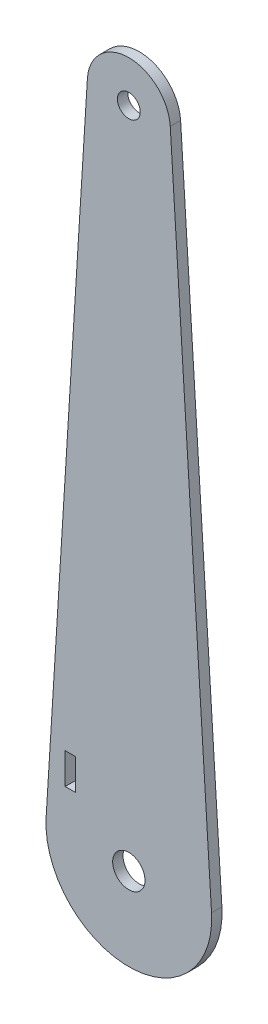
ISO-10303-21;
HEADER;
FILE_DESCRIPTION(('STEP AP214'),'2;1');
FILE_NAME('part.step','',(''),(''),'','','');
FILE_SCHEMA(('AUTOMOTIVE_DESIGN { 1 0 10303 214 1 1 1 1 }'));
ENDSEC;
DATA;
#1=APPLICATION_CONTEXT('core data for automotive mechanical design processes');
#2=APPLICATION_PROTOCOL_DEFINITION('international standard','automotive_design',2000,#1);
#3=PRODUCT_CONTEXT('',#1,'mechanical');
#4=PRODUCT('Part','Part','',(#3));
#5=PRODUCT_RELATED_PRODUCT_CATEGORY('part','',(#4));
#6=PRODUCT_DEFINITION_FORMATION('','',#4);
#7=PRODUCT_DEFINITION_CONTEXT('part definition',#1,'design');
#8=PRODUCT_DEFINITION('design','',#6,#7);
#9=PRODUCT_DEFINITION_SHAPE('','',#8);
#10=(LENGTH_UNIT() NAMED_UNIT(*) SI_UNIT(.MILLI.,.METRE.));
#11=(NAMED_UNIT(*) PLANE_ANGLE_UNIT() SI_UNIT($,.RADIAN.));
#12=(NAMED_UNIT(*) SI_UNIT($,.STERADIAN.) SOLID_ANGLE_UNIT());
#13=UNCERTAINTY_MEASURE_WITH_UNIT(LENGTH_MEASURE(1.E-05),#10,'distance_accuracy_value','');
#14=(GEOMETRIC_REPRESENTATION_CONTEXT(3) GLOBAL_UNCERTAINTY_ASSIGNED_CONTEXT((#13)) GLOBAL_UNIT_ASSIGNED_CONTEXT((#10,
#11,#12)) REPRESENTATION_CONTEXT('',''));
#15=CARTESIAN_POINT('',(0.,0.,0.));
#16=DIRECTION('',(0.,0.,1.));
#17=DIRECTION('',(1.,0.,0.));
#18=AXIS2_PLACEMENT_3D('',#15,#16,#17);
#19=CARTESIAN_POINT('',(0.,0.,3.175));
#20=DIRECTION('',(0.,0.,-1.));
#21=DIRECTION('',(-1.,0.,0.));
#22=AXIS2_PLACEMENT_3D('',#19,#20,#21);
#23=PLANE('',#22);
#24=CARTESIAN_POINT('',(0.,0.,3.175));
#25=DIRECTION('',(0.,0.,1.));
#26=DIRECTION('',(1.,0.,0.));
#27=AXIS2_PLACEMENT_3D('',#24,#25,#26);
#28=CIRCLE('',#27,4.953);
#29=CARTESIAN_POINT('',(4.953,0.,3.175));
#30=VERTEX_POINT('',#29);
#31=EDGE_CURVE('E143',#30,#30,#28,.T.);
#32=ORIENTED_EDGE('',*,*,#31,.F.);
#33=EDGE_LOOP('',(#32));
#34=FACE_BOUND('',#33,.T.);
#35=CARTESIAN_POINT('',(0.,0.,3.175));
#36=DIRECTION('',(0.,0.,1.));
#37=DIRECTION('',(-1.,0.,0.));
#38=AXIS2_PLACEMENT_3D('',#35,#36,#37);
#39=CIRCLE('',#38,25.4);
#40=CARTESIAN_POINT('',(-25.3505358690084,1.58440245964209,3.175));
#41=VERTEX_POINT('',#40);
#42=CARTESIAN_POINT('',(25.3505358690084,1.58440245964209,3.175));
#43=VERTEX_POINT('',#42);
#44=EDGE_CURVE('E149',#41,#43,#39,.T.);
#45=ORIENTED_EDGE('',*,*,#44,.T.);
#46=DIRECTION('',(-0.062378049592208,0.998052593268046,0.));
#47=VECTOR('',#46,1.);
#48=CARTESIAN_POINT('',(25.3505358690084,1.58440245964209,3.175));
#49=LINE('',#48,#47);
#50=CARTESIAN_POINT('',(12.7,203.993746978029,3.175));
#51=VERTEX_POINT('',#50);
#52=EDGE_CURVE('E152',#43,#51,#49,.T.);
#53=ORIENTED_EDGE('',*,*,#52,.T.);
#54=CARTESIAN_POINT('',(0.,203.2,3.175));
#55=DIRECTION('',(0.,0.,1.));
#56=DIRECTION('',(-1.,0.,0.));
#57=AXIS2_PLACEMENT_3D('',#54,#55,#56);
#58=CIRCLE('',#57,12.7247803228633);
#59=CARTESIAN_POINT('',(-12.7,203.993746978029,3.175));
#60=VERTEX_POINT('',#59);
#61=EDGE_CURVE('E155',#51,#60,#58,.T.);
#62=ORIENTED_EDGE('',*,*,#61,.T.);
#63=DIRECTION('',(-0.062378049592208,-0.998052593268046,0.));
#64=VECTOR('',#63,1.);
#65=CARTESIAN_POINT('',(-25.3505358690084,1.58440245964209,3.175));
#66=LINE('',#65,#64);
#67=EDGE_CURVE('E157',#60,#41,#66,.T.);
#68=ORIENTED_EDGE('',*,*,#67,.T.);
#69=EDGE_LOOP('',(#45,#53,#62,#68));
#70=FACE_BOUND('',#69,.T.);
#71=DIRECTION('',(0.,-1.,0.));
#72=VECTOR('',#71,1.);
#73=CARTESIAN_POINT('',(-19.5072,22.225,3.175));
#74=LINE('',#73,#72);
#75=CARTESIAN_POINT('',(-19.5072,22.225,3.175));
#76=VERTEX_POINT('',#75);
#77=CARTESIAN_POINT('',(-19.5072,12.7,3.175));
#78=VERTEX_POINT('',#77);
#79=EDGE_CURVE('E104',#76,#78,#74,.T.);
#80=ORIENTED_EDGE('',*,*,#79,.F.);
#81=DIRECTION('',(-1.,0.,0.));
#82=VECTOR('',#81,1.);
#83=CARTESIAN_POINT('',(-19.5072,22.225,3.175));
#84=LINE('',#83,#82);
#85=CARTESIAN_POINT('',(-16.3322,22.225,3.175));
#86=VERTEX_POINT('',#85);
#87=EDGE_CURVE('E127',#86,#76,#84,.T.);
#88=ORIENTED_EDGE('',*,*,#87,.F.);
#89=DIRECTION('',(0.,1.,0.));
#90=VECTOR('',#89,1.);
#91=CARTESIAN_POINT('',(-16.3322,22.225,3.175));
#92=LINE('',#91,#90);
#93=CARTESIAN_POINT('',(-16.3322,12.7,3.175));
#94=VERTEX_POINT('',#93);
#95=EDGE_CURVE('E125',#94,#86,#92,.T.);
#96=ORIENTED_EDGE('',*,*,#95,.F.);
#97=DIRECTION('',(1.,0.,0.));
#98=VECTOR('',#97,1.);
#99=CARTESIAN_POINT('',(-19.5072,12.7,3.175));
#100=LINE('',#99,#98);
#101=EDGE_CURVE('E112',#78,#94,#100,.T.);
#102=ORIENTED_EDGE('',*,*,#101,.F.);
#103=EDGE_LOOP('',(#80,#88,#96,#102));
#104=FACE_BOUND('',#103,.T.);
#105=CARTESIAN_POINT('',(0.,203.2,3.175));
#106=DIRECTION('',(0.,0.,1.));
#107=DIRECTION('',(1.,0.,0.));
#108=AXIS2_PLACEMENT_3D('',#105,#106,#107);
#109=CIRCLE('',#108,3.5);
#110=CARTESIAN_POINT('',(3.5,203.2,3.175));
#111=VERTEX_POINT('',#110);
#112=EDGE_CURVE('E133',#111,#111,#109,.T.);
#113=ORIENTED_EDGE('',*,*,#112,.F.);
#114=EDGE_LOOP('',(#113));
#115=FACE_BOUND('',#114,.T.);
#116=ADVANCED_FACE('F39',(#34,#70,#104,#115),#23,.F.);
#117=CARTESIAN_POINT('',(0.,0.,0.));
#118=DIRECTION('',(0.,0.,-1.));
#119=DIRECTION('',(-1.,0.,0.));
#120=AXIS2_PLACEMENT_3D('',#117,#118,#119);
#121=PLANE('',#120);
#122=DIRECTION('',(-1.,0.,0.));
#123=VECTOR('',#122,1.);
#124=CARTESIAN_POINT('',(-19.5072,22.225,0.));
#125=LINE('',#124,#123);
#126=CARTESIAN_POINT('',(-16.3322,22.225,0.));
#127=VERTEX_POINT('',#126);
#128=CARTESIAN_POINT('',(-19.5072,22.225,0.));
#129=VERTEX_POINT('',#128);
#130=EDGE_CURVE('E113',#127,#129,#125,.T.);
#131=ORIENTED_EDGE('',*,*,#130,.T.);
#132=DIRECTION('',(0.,-1.,0.));
#133=VECTOR('',#132,1.);
#134=CARTESIAN_POINT('',(-19.5072,22.225,0.));
#135=LINE('',#134,#133);
#136=CARTESIAN_POINT('',(-19.5072,12.7,0.));
#137=VERTEX_POINT('',#136);
#138=EDGE_CURVE('E62',#129,#137,#135,.T.);
#139=ORIENTED_EDGE('',*,*,#138,.T.);
#140=DIRECTION('',(1.,0.,0.));
#141=VECTOR('',#140,1.);
#142=CARTESIAN_POINT('',(-19.5072,12.7,0.));
#143=LINE('',#142,#141);
#144=CARTESIAN_POINT('',(-16.3322,12.7,0.));
#145=VERTEX_POINT('',#144);
#146=EDGE_CURVE('E119',#137,#145,#143,.T.);
#147=ORIENTED_EDGE('',*,*,#146,.T.);
#148=DIRECTION('',(0.,1.,0.));
#149=VECTOR('',#148,1.);
#150=CARTESIAN_POINT('',(-16.3322,22.225,0.));
#151=LINE('',#150,#149);
#152=EDGE_CURVE('E135',#145,#127,#151,.T.);
#153=ORIENTED_EDGE('',*,*,#152,.T.);
#154=EDGE_LOOP('',(#131,#139,#147,#153));
#155=FACE_BOUND('',#154,.T.);
#156=CARTESIAN_POINT('',(0.,0.,0.));
#157=DIRECTION('',(0.,0.,1.));
#158=DIRECTION('',(1.,0.,0.));
#159=AXIS2_PLACEMENT_3D('',#156,#157,#158);
#160=CIRCLE('',#159,4.953);
#161=CARTESIAN_POINT('',(4.953,0.,0.));
#162=VERTEX_POINT('',#161);
#163=EDGE_CURVE('E120',#162,#162,#160,.T.);
#164=ORIENTED_EDGE('',*,*,#163,.T.);
#165=EDGE_LOOP('',(#164));
#166=FACE_BOUND('',#165,.T.);
#167=CARTESIAN_POINT('',(0.,0.,0.));
#168=DIRECTION('',(0.,0.,1.));
#169=DIRECTION('',(-1.,0.,0.));
#170=AXIS2_PLACEMENT_3D('',#167,#168,#169);
#171=CIRCLE('',#170,25.4);
#172=CARTESIAN_POINT('',(-25.3505358690084,1.58440245964209,0.));
#173=VERTEX_POINT('',#172);
#174=CARTESIAN_POINT('',(25.3505358690084,1.58440245964209,0.));
#175=VERTEX_POINT('',#174);
#176=EDGE_CURVE('E146',#173,#175,#171,.T.);
#177=ORIENTED_EDGE('',*,*,#176,.F.);
#178=DIRECTION('',(-0.062378049592208,-0.998052593268046,0.));
#179=VECTOR('',#178,1.);
#180=CARTESIAN_POINT('',(-25.3505358690084,1.58440245964209,0.));
#181=LINE('',#180,#179);
#182=CARTESIAN_POINT('',(-12.7,203.993746978029,0.));
#183=VERTEX_POINT('',#182);
#184=EDGE_CURVE('E153',#183,#173,#181,.T.);
#185=ORIENTED_EDGE('',*,*,#184,.F.);
#186=CARTESIAN_POINT('',(0.,203.2,0.));
#187=DIRECTION('',(0.,0.,1.));
#188=DIRECTION('',(-1.,0.,0.));
#189=AXIS2_PLACEMENT_3D('',#186,#187,#188);
#190=CIRCLE('',#189,12.7247803228633);
#191=CARTESIAN_POINT('',(12.7,203.993746978029,0.));
#192=VERTEX_POINT('',#191);
#193=EDGE_CURVE('E164',#192,#183,#190,.T.);
#194=ORIENTED_EDGE('',*,*,#193,.F.);
#195=DIRECTION('',(-0.062378049592208,0.998052593268046,0.));
#196=VECTOR('',#195,1.);
#197=CARTESIAN_POINT('',(25.3505358690084,1.58440245964209,0.));
#198=LINE('',#197,#196);
#199=EDGE_CURVE('E162',#175,#192,#198,.T.);
#200=ORIENTED_EDGE('',*,*,#199,.F.);
#201=EDGE_LOOP('',(#177,#185,#194,#200));
#202=FACE_BOUND('',#201,.T.);
#203=CARTESIAN_POINT('',(0.,203.2,0.));
#204=DIRECTION('',(0.,0.,1.));
#205=DIRECTION('',(1.,0.,0.));
#206=AXIS2_PLACEMENT_3D('',#203,#204,#205);
#207=CIRCLE('',#206,3.5);
#208=CARTESIAN_POINT('',(3.5,203.2,0.));
#209=VERTEX_POINT('',#208);
#210=EDGE_CURVE('E245',#209,#209,#207,.T.);
#211=ORIENTED_EDGE('',*,*,#210,.T.);
#212=EDGE_LOOP('',(#211));
#213=FACE_BOUND('',#212,.T.);
#214=ADVANCED_FACE('F182',(#155,#166,#202,#213),#121,.T.);
#215=CARTESIAN_POINT('',(0.,0.,3.175));
#216=DIRECTION('',(0.,0.,-1.));
#217=DIRECTION('',(-1.,0.,0.));
#218=AXIS2_PLACEMENT_3D('',#215,#216,#217);
#219=CYLINDRICAL_SURFACE('',#218,25.4);
#220=ORIENTED_EDGE('',*,*,#176,.T.);
#221=DIRECTION('',(0.,0.,-1.));
#222=VECTOR('',#221,1.);
#223=CARTESIAN_POINT('',(25.3505358690084,1.58440245964209,3.175));
#224=LINE('',#223,#222);
#225=EDGE_CURVE('E11',#43,#175,#224,.T.);
#226=ORIENTED_EDGE('',*,*,#225,.F.);
#227=ORIENTED_EDGE('',*,*,#44,.F.);
#228=DIRECTION('',(0.,0.,-1.));
#229=VECTOR('',#228,1.);
#230=CARTESIAN_POINT('',(-25.3505358690084,1.58440245964209,3.175));
#231=LINE('',#230,#229);
#232=EDGE_CURVE('E159',#41,#173,#231,.T.);
#233=ORIENTED_EDGE('',*,*,#232,.T.);
#234=EDGE_LOOP('',(#220,#226,#227,#233));
#235=FACE_BOUND('',#234,.T.);
#236=ADVANCED_FACE('F41',(#235),#219,.T.);
#237=CARTESIAN_POINT('',(25.3505358690084,1.58440245964209,3.175));
#238=DIRECTION('',(-0.998052593268046,-0.062378049592208,0.));
#239=DIRECTION('',(0.062378049592208,-0.998052593268046,0.));
#240=AXIS2_PLACEMENT_3D('',#237,#238,#239);
#241=PLANE('',#240);
#242=ORIENTED_EDGE('',*,*,#199,.T.);
#243=DIRECTION('',(0.,0.,-1.));
#244=VECTOR('',#243,1.);
#245=CARTESIAN_POINT('',(12.7,203.993746978029,3.175));
#246=LINE('',#245,#244);
#247=EDGE_CURVE('E47',#51,#192,#246,.T.);
#248=ORIENTED_EDGE('',*,*,#247,.F.);
#249=ORIENTED_EDGE('',*,*,#52,.F.);
#250=ORIENTED_EDGE('',*,*,#225,.T.);
#251=EDGE_LOOP('',(#242,#248,#249,#250));
#252=FACE_BOUND('',#251,.T.);
#253=ADVANCED_FACE('F192',(#252),#241,.F.);
#254=CARTESIAN_POINT('',(0.,203.2,3.175));
#255=DIRECTION('',(0.,0.,-1.));
#256=DIRECTION('',(-1.,0.,0.));
#257=AXIS2_PLACEMENT_3D('',#254,#255,#256);
#258=CYLINDRICAL_SURFACE('',#257,12.7247803228633);
#259=ORIENTED_EDGE('',*,*,#193,.T.);
#260=DIRECTION('',(0.,0.,-1.));
#261=VECTOR('',#260,1.);
#262=CARTESIAN_POINT('',(-12.7,203.993746978029,3.175));
#263=LINE('',#262,#261);
#264=EDGE_CURVE('E169',#60,#183,#263,.T.);
#265=ORIENTED_EDGE('',*,*,#264,.F.);
#266=ORIENTED_EDGE('',*,*,#61,.F.);
#267=ORIENTED_EDGE('',*,*,#247,.T.);
#268=EDGE_LOOP('',(#259,#265,#266,#267));
#269=FACE_BOUND('',#268,.T.);
#270=ADVANCED_FACE('F176',(#269),#258,.T.);
#271=CARTESIAN_POINT('',(-25.3505358690084,1.58440245964209,3.175));
#272=DIRECTION('',(0.998052593268046,-0.062378049592208,0.));
#273=DIRECTION('',(0.062378049592208,0.998052593268046,0.));
#274=AXIS2_PLACEMENT_3D('',#271,#272,#273);
#275=PLANE('',#274);
#276=ORIENTED_EDGE('',*,*,#184,.T.);
#277=ORIENTED_EDGE('',*,*,#232,.F.);
#278=ORIENTED_EDGE('',*,*,#67,.F.);
#279=ORIENTED_EDGE('',*,*,#264,.T.);
#280=EDGE_LOOP('',(#276,#277,#278,#279));
#281=FACE_BOUND('',#280,.T.);
#282=ADVANCED_FACE('F186',(#281),#275,.F.);
#283=CARTESIAN_POINT('',(0.,0.,3.175));
#284=DIRECTION('',(0.,0.,-1.));
#285=DIRECTION('',(-1.,0.,0.));
#286=AXIS2_PLACEMENT_3D('',#283,#284,#285);
#287=CYLINDRICAL_SURFACE('',#286,4.953);
#288=ORIENTED_EDGE('',*,*,#31,.T.);
#289=EDGE_LOOP('',(#288));
#290=FACE_BOUND('',#289,.T.);
#291=ORIENTED_EDGE('',*,*,#163,.F.);
#292=EDGE_LOOP('',(#291));
#293=FACE_BOUND('',#292,.T.);
#294=ADVANCED_FACE('F209',(#290,#293),#287,.F.);
#295=CARTESIAN_POINT('',(-19.5072,22.225,3.175));
#296=DIRECTION('',(1.,0.,0.));
#297=DIRECTION('',(0.,0.,-1.));
#298=AXIS2_PLACEMENT_3D('',#295,#296,#297);
#299=PLANE('',#298);
#300=ORIENTED_EDGE('',*,*,#138,.F.);
#301=DIRECTION('',(0.,0.,-1.));
#302=VECTOR('',#301,1.);
#303=CARTESIAN_POINT('',(-19.5072,22.225,3.175));
#304=LINE('',#303,#302);
#305=EDGE_CURVE('E108',#76,#129,#304,.T.);
#306=ORIENTED_EDGE('',*,*,#305,.F.);
#307=ORIENTED_EDGE('',*,*,#79,.T.);
#308=DIRECTION('',(0.,0.,-1.));
#309=VECTOR('',#308,1.);
#310=CARTESIAN_POINT('',(-19.5072,12.7,3.175));
#311=LINE('',#310,#309);
#312=EDGE_CURVE('E107',#78,#137,#311,.T.);
#313=ORIENTED_EDGE('',*,*,#312,.T.);
#314=EDGE_LOOP('',(#300,#306,#307,#313));
#315=FACE_BOUND('',#314,.T.);
#316=ADVANCED_FACE('F106',(#315),#299,.T.);
#317=CARTESIAN_POINT('',(-19.5072,12.7,3.175));
#318=DIRECTION('',(0.,1.,0.));
#319=DIRECTION('',(0.,0.,1.));
#320=AXIS2_PLACEMENT_3D('',#317,#318,#319);
#321=PLANE('',#320);
#322=ORIENTED_EDGE('',*,*,#146,.F.);
#323=ORIENTED_EDGE('',*,*,#312,.F.);
#324=ORIENTED_EDGE('',*,*,#101,.T.);
#325=DIRECTION('',(0.,0.,-1.));
#326=VECTOR('',#325,1.);
#327=CARTESIAN_POINT('',(-16.3322,12.7,3.175));
#328=LINE('',#327,#326);
#329=EDGE_CURVE('E121',#94,#145,#328,.T.);
#330=ORIENTED_EDGE('',*,*,#329,.T.);
#331=EDGE_LOOP('',(#322,#323,#324,#330));
#332=FACE_BOUND('',#331,.T.);
#333=ADVANCED_FACE('F116',(#332),#321,.T.);
#334=CARTESIAN_POINT('',(-16.3322,22.225,3.175));
#335=DIRECTION('',(-1.,0.,0.));
#336=DIRECTION('',(0.,-1.,0.));
#337=AXIS2_PLACEMENT_3D('',#334,#335,#336);
#338=PLANE('',#337);
#339=ORIENTED_EDGE('',*,*,#152,.F.);
#340=ORIENTED_EDGE('',*,*,#329,.F.);
#341=ORIENTED_EDGE('',*,*,#95,.T.);
#342=DIRECTION('',(0.,0.,-1.));
#343=VECTOR('',#342,1.);
#344=CARTESIAN_POINT('',(-16.3322,22.225,3.175));
#345=LINE('',#344,#343);
#346=EDGE_CURVE('E54',#86,#127,#345,.T.);
#347=ORIENTED_EDGE('',*,*,#346,.T.);
#348=EDGE_LOOP('',(#339,#340,#341,#347));
#349=FACE_BOUND('',#348,.T.);
#350=ADVANCED_FACE('F226',(#349),#338,.T.);
#351=CARTESIAN_POINT('',(-19.5072,22.225,3.175));
#352=DIRECTION('',(0.,-1.,0.));
#353=DIRECTION('',(0.,0.,-1.));
#354=AXIS2_PLACEMENT_3D('',#351,#352,#353);
#355=PLANE('',#354);
#356=ORIENTED_EDGE('',*,*,#130,.F.);
#357=ORIENTED_EDGE('',*,*,#346,.F.);
#358=ORIENTED_EDGE('',*,*,#87,.T.);
#359=ORIENTED_EDGE('',*,*,#305,.T.);
#360=EDGE_LOOP('',(#356,#357,#358,#359));
#361=FACE_BOUND('',#360,.T.);
#362=ADVANCED_FACE('F231',(#361),#355,.T.);
#363=CARTESIAN_POINT('',(0.,203.2,3.175));
#364=DIRECTION('',(0.,0.,-1.));
#365=DIRECTION('',(-1.,0.,0.));
#366=AXIS2_PLACEMENT_3D('',#363,#364,#365);
#367=CYLINDRICAL_SURFACE('',#366,3.5);
#368=ORIENTED_EDGE('',*,*,#112,.T.);
#369=EDGE_LOOP('',(#368));
#370=FACE_BOUND('',#369,.T.);
#371=ORIENTED_EDGE('',*,*,#210,.F.);
#372=EDGE_LOOP('',(#371));
#373=FACE_BOUND('',#372,.T.);
#374=ADVANCED_FACE('F235',(#370,#373),#367,.F.);
#375=CLOSED_SHELL('',(#116,#214,#236,#253,#270,#282,#294,#316,#333,#350,#362,#374));
#376=MANIFOLD_SOLID_BREP('B2',#375);
#377=ADVANCED_BREP_SHAPE_REPRESENTATION('',(#18,#376),#14);
#378=SHAPE_DEFINITION_REPRESENTATION(#9,#377);
ENDSEC;
END-ISO-10303-21;
